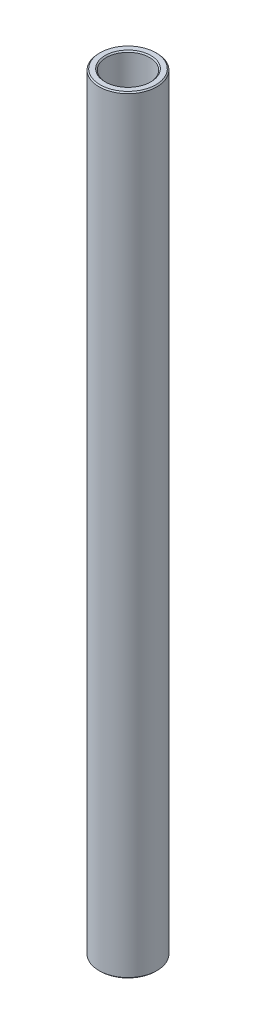
ISO-10303-21;
HEADER;
FILE_DESCRIPTION(('STEP AP214'),'2;1');
FILE_NAME('part.step','',(''),(''),'','','');
FILE_SCHEMA(('AUTOMOTIVE_DESIGN { 1 0 10303 214 1 1 1 1 }'));
ENDSEC;
DATA;
#1=APPLICATION_CONTEXT('core data for automotive mechanical design processes');
#2=APPLICATION_PROTOCOL_DEFINITION('international standard','automotive_design',2000,#1);
#3=PRODUCT_CONTEXT('',#1,'mechanical');
#4=PRODUCT('Part','Part','',(#3));
#5=PRODUCT_RELATED_PRODUCT_CATEGORY('part','',(#4));
#6=PRODUCT_DEFINITION_FORMATION('','',#4);
#7=PRODUCT_DEFINITION_CONTEXT('part definition',#1,'design');
#8=PRODUCT_DEFINITION('design','',#6,#7);
#9=PRODUCT_DEFINITION_SHAPE('','',#8);
#10=(LENGTH_UNIT() NAMED_UNIT(*) SI_UNIT(.MILLI.,.METRE.));
#11=(NAMED_UNIT(*) PLANE_ANGLE_UNIT() SI_UNIT($,.RADIAN.));
#12=(NAMED_UNIT(*) SI_UNIT($,.STERADIAN.) SOLID_ANGLE_UNIT());
#13=UNCERTAINTY_MEASURE_WITH_UNIT(LENGTH_MEASURE(1.E-05),#10,'distance_accuracy_value','');
#14=(GEOMETRIC_REPRESENTATION_CONTEXT(3) GLOBAL_UNCERTAINTY_ASSIGNED_CONTEXT((#13)) GLOBAL_UNIT_ASSIGNED_CONTEXT((#10,
#11,#12)) REPRESENTATION_CONTEXT('',''));
#15=CARTESIAN_POINT('',(0.,0.,0.));
#16=DIRECTION('',(0.,0.,1.));
#17=DIRECTION('',(1.,0.,0.));
#18=AXIS2_PLACEMENT_3D('',#15,#16,#17);
#19=CARTESIAN_POINT('',(0.,11.60859375,0.));
#20=DIRECTION('',(0.,1.,0.));
#21=DIRECTION('',(-1.,0.,0.));
#22=AXIS2_PLACEMENT_3D('',#19,#20,#21);
#23=CYLINDRICAL_SURFACE('',#22,4.7625);
#24=CARTESIAN_POINT('',(0.,-83.8835,0.));
#25=DIRECTION('',(0.,1.,0.));
#26=DIRECTION('',(-1.,0.,0.));
#27=AXIS2_PLACEMENT_3D('',#24,#25,#26);
#28=CIRCLE('',#27,4.7625);
#29=CARTESIAN_POINT('',(-4.7625,-83.8835,0.));
#30=VERTEX_POINT('',#29);
#31=EDGE_CURVE('E50',#30,#30,#28,.F.);
#32=ORIENTED_EDGE('',*,*,#31,.T.);
#33=EDGE_LOOP('',(#32));
#34=FACE_BOUND('',#33,.T.);
#35=CARTESIAN_POINT('',(0.,83.8835,0.));
#36=DIRECTION('',(0.,-1.,0.));
#37=DIRECTION('',(1.,0.,0.));
#38=AXIS2_PLACEMENT_3D('',#35,#36,#37);
#39=CIRCLE('',#38,4.7625);
#40=CARTESIAN_POINT('',(4.76250000000001,83.8835,0.));
#41=VERTEX_POINT('',#40);
#42=EDGE_CURVE('E53',#41,#41,#39,.F.);
#43=ORIENTED_EDGE('',*,*,#42,.T.);
#44=EDGE_LOOP('',(#43));
#45=FACE_BOUND('',#44,.T.);
#46=ADVANCED_FACE('F30',(#34,#45),#23,.F.);
#47=CARTESIAN_POINT('',(4.76249999999999,84.1375,0.));
#48=DIRECTION('',(0.,-1.,0.));
#49=DIRECTION('',(1.,0.,0.));
#50=AXIS2_PLACEMENT_3D('',#47,#48,#49);
#51=PLANE('',#50);
#52=CARTESIAN_POINT('',(0.,84.1375,0.));
#53=DIRECTION('',(0.,-1.,0.));
#54=DIRECTION('',(1.,0.,0.));
#55=AXIS2_PLACEMENT_3D('',#52,#53,#54);
#56=CIRCLE('',#55,6.09599999999999);
#57=CARTESIAN_POINT('',(6.096,84.1375,0.));
#58=VERTEX_POINT('',#57);
#59=EDGE_CURVE('E10',#58,#58,#56,.F.);
#60=ORIENTED_EDGE('',*,*,#59,.T.);
#61=EDGE_LOOP('',(#60));
#62=FACE_BOUND('',#61,.T.);
#63=CARTESIAN_POINT('',(0.,84.1375,0.));
#64=DIRECTION('',(0.,-1.,0.));
#65=DIRECTION('',(1.,0.,0.));
#66=AXIS2_PLACEMENT_3D('',#63,#64,#65);
#67=CIRCLE('',#66,5.01649999999998);
#68=CARTESIAN_POINT('',(5.01649999999999,84.1375,0.));
#69=VERTEX_POINT('',#68);
#70=EDGE_CURVE('E37',#69,#69,#67,.T.);
#71=ORIENTED_EDGE('',*,*,#70,.T.);
#72=EDGE_LOOP('',(#71));
#73=FACE_BOUND('',#72,.T.);
#74=ADVANCED_FACE('F76',(#62,#73),#51,.F.);
#75=CARTESIAN_POINT('',(0.,11.60859375,0.));
#76=DIRECTION('',(0.,1.,0.));
#77=DIRECTION('',(-1.,0.,0.));
#78=AXIS2_PLACEMENT_3D('',#75,#76,#77);
#79=CYLINDRICAL_SURFACE('',#78,6.35);
#80=CARTESIAN_POINT('',(0.,-83.8835,0.));
#81=DIRECTION('',(0.,1.,0.));
#82=DIRECTION('',(-1.,0.,0.));
#83=AXIS2_PLACEMENT_3D('',#80,#81,#82);
#84=CIRCLE('',#83,6.35);
#85=CARTESIAN_POINT('',(-6.35000000000001,-83.8835,0.));
#86=VERTEX_POINT('',#85);
#87=EDGE_CURVE('E41',#86,#86,#84,.T.);
#88=ORIENTED_EDGE('',*,*,#87,.T.);
#89=EDGE_LOOP('',(#88));
#90=FACE_BOUND('',#89,.T.);
#91=CARTESIAN_POINT('',(0.,83.8835,0.));
#92=DIRECTION('',(0.,-1.,0.));
#93=DIRECTION('',(1.,0.,0.));
#94=AXIS2_PLACEMENT_3D('',#91,#92,#93);
#95=CIRCLE('',#94,6.35);
#96=CARTESIAN_POINT('',(6.35000000000001,83.8835,0.));
#97=VERTEX_POINT('',#96);
#98=EDGE_CURVE('E45',#97,#97,#95,.T.);
#99=ORIENTED_EDGE('',*,*,#98,.T.);
#100=EDGE_LOOP('',(#99));
#101=FACE_BOUND('',#100,.T.);
#102=ADVANCED_FACE('F73',(#90,#101),#79,.T.);
#103=CARTESIAN_POINT('',(6.35000000000001,-84.1375,0.));
#104=DIRECTION('',(0.,1.,0.));
#105=DIRECTION('',(-1.,0.,0.));
#106=AXIS2_PLACEMENT_3D('',#103,#104,#105);
#107=PLANE('',#106);
#108=CARTESIAN_POINT('',(0.,-84.1375,0.));
#109=DIRECTION('',(0.,1.,0.));
#110=DIRECTION('',(-1.,0.,0.));
#111=AXIS2_PLACEMENT_3D('',#108,#109,#110);
#112=CIRCLE('',#111,5.01650000000002);
#113=CARTESIAN_POINT('',(-5.01650000000003,-84.1375,0.));
#114=VERTEX_POINT('',#113);
#115=EDGE_CURVE('E56',#114,#114,#112,.T.);
#116=ORIENTED_EDGE('',*,*,#115,.T.);
#117=EDGE_LOOP('',(#116));
#118=FACE_BOUND('',#117,.T.);
#119=CARTESIAN_POINT('',(0.,-84.1375,0.));
#120=DIRECTION('',(0.,1.,0.));
#121=DIRECTION('',(-1.,0.,0.));
#122=AXIS2_PLACEMENT_3D('',#119,#120,#121);
#123=CIRCLE('',#122,6.09600000000002);
#124=CARTESIAN_POINT('',(-6.09600000000003,-84.1375,0.));
#125=VERTEX_POINT('',#124);
#126=EDGE_CURVE('E59',#125,#125,#123,.F.);
#127=ORIENTED_EDGE('',*,*,#126,.T.);
#128=EDGE_LOOP('',(#127));
#129=FACE_BOUND('',#128,.T.);
#130=ADVANCED_FACE('F63',(#118,#129),#107,.F.);
#131=CARTESIAN_POINT('',(0.,-84.1375,0.));
#132=DIRECTION('',(0.,-1.,0.));
#133=DIRECTION('',(1.,0.,0.));
#134=AXIS2_PLACEMENT_3D('',#131,#132,#133);
#135=CONICAL_SURFACE('',#134,5.01650000000002,0.78539816339746);
#136=ORIENTED_EDGE('',*,*,#31,.F.);
#137=EDGE_LOOP('',(#136));
#138=FACE_BOUND('',#137,.T.);
#139=ORIENTED_EDGE('',*,*,#115,.F.);
#140=EDGE_LOOP('',(#139));
#141=FACE_BOUND('',#140,.T.);
#142=ADVANCED_FACE('F69',(#138,#141),#135,.F.);
#143=CARTESIAN_POINT('',(0.,-83.8835,0.));
#144=DIRECTION('',(0.,1.,0.));
#145=DIRECTION('',(-1.,0.,0.));
#146=AXIS2_PLACEMENT_3D('',#143,#144,#145);
#147=CONICAL_SURFACE('',#146,6.35,0.785398163397433);
#148=ORIENTED_EDGE('',*,*,#126,.F.);
#149=EDGE_LOOP('',(#148));
#150=FACE_BOUND('',#149,.T.);
#151=ORIENTED_EDGE('',*,*,#87,.F.);
#152=EDGE_LOOP('',(#151));
#153=FACE_BOUND('',#152,.T.);
#154=ADVANCED_FACE('F65',(#150,#153),#147,.T.);
#155=CARTESIAN_POINT('',(0.,84.1375,0.));
#156=DIRECTION('',(0.,-1.,0.));
#157=DIRECTION('',(1.,0.,0.));
#158=AXIS2_PLACEMENT_3D('',#155,#156,#157);
#159=CONICAL_SURFACE('',#158,6.09599999999999,0.785398163397433);
#160=ORIENTED_EDGE('',*,*,#98,.F.);
#161=EDGE_LOOP('',(#160));
#162=FACE_BOUND('',#161,.T.);
#163=ORIENTED_EDGE('',*,*,#59,.F.);
#164=EDGE_LOOP('',(#163));
#165=FACE_BOUND('',#164,.T.);
#166=ADVANCED_FACE('F68',(#162,#165),#159,.T.);
#167=CARTESIAN_POINT('',(0.,83.8835,0.));
#168=DIRECTION('',(0.,1.,0.));
#169=DIRECTION('',(-1.,0.,0.));
#170=AXIS2_PLACEMENT_3D('',#167,#168,#169);
#171=CONICAL_SURFACE('',#170,4.7625,0.78539816339746);
#172=ORIENTED_EDGE('',*,*,#70,.F.);
#173=EDGE_LOOP('',(#172));
#174=FACE_BOUND('',#173,.T.);
#175=ORIENTED_EDGE('',*,*,#42,.F.);
#176=EDGE_LOOP('',(#175));
#177=FACE_BOUND('',#176,.T.);
#178=ADVANCED_FACE('F32',(#174,#177),#171,.F.);
#179=CLOSED_SHELL('',(#46,#74,#102,#130,#142,#154,#166,#178));
#180=MANIFOLD_SOLID_BREP('B2',#179);
#181=ADVANCED_BREP_SHAPE_REPRESENTATION('',(#18,#180),#14);
#182=SHAPE_DEFINITION_REPRESENTATION(#9,#181);
ENDSEC;
END-ISO-10303-21;
